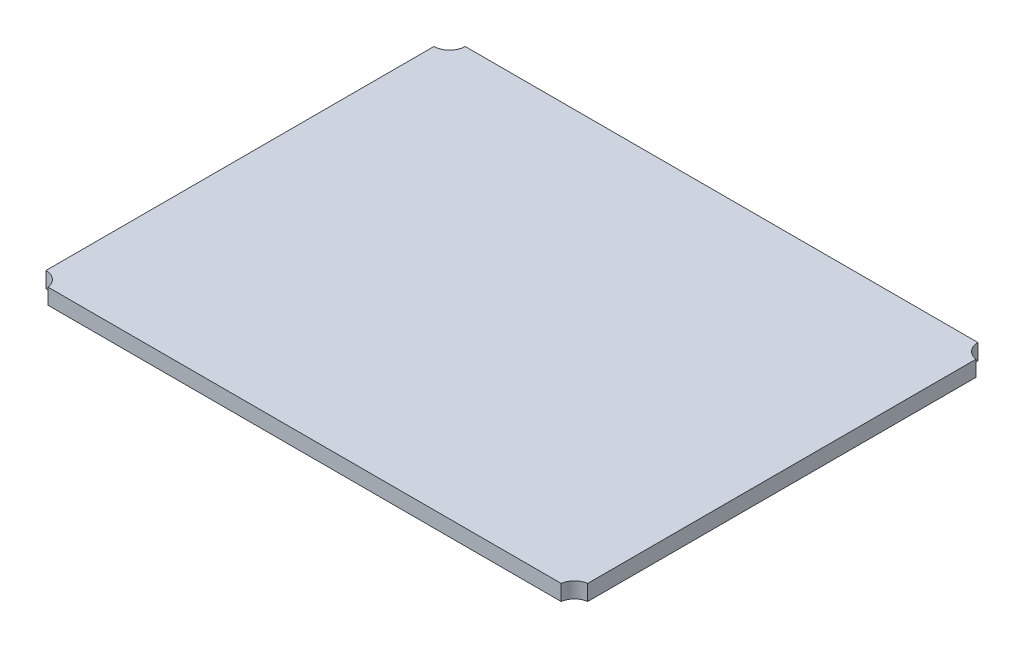
ISO-10303-21;
HEADER;
FILE_DESCRIPTION(('STEP AP214'),'2;1');
FILE_NAME('part.step','',(''),(''),'','','');
FILE_SCHEMA(('AUTOMOTIVE_DESIGN { 1 0 10303 214 1 1 1 1 }'));
ENDSEC;
DATA;
#1=APPLICATION_CONTEXT('core data for automotive mechanical design processes');
#2=APPLICATION_PROTOCOL_DEFINITION('international standard','automotive_design',2000,#1);
#3=PRODUCT_CONTEXT('',#1,'mechanical');
#4=PRODUCT('Part','Part','',(#3));
#5=PRODUCT_RELATED_PRODUCT_CATEGORY('part','',(#4));
#6=PRODUCT_DEFINITION_FORMATION('','',#4);
#7=PRODUCT_DEFINITION_CONTEXT('part definition',#1,'design');
#8=PRODUCT_DEFINITION('design','',#6,#7);
#9=PRODUCT_DEFINITION_SHAPE('','',#8);
#10=(LENGTH_UNIT() NAMED_UNIT(*) SI_UNIT(.MILLI.,.METRE.));
#11=(NAMED_UNIT(*) PLANE_ANGLE_UNIT() SI_UNIT($,.RADIAN.));
#12=(NAMED_UNIT(*) SI_UNIT($,.STERADIAN.) SOLID_ANGLE_UNIT());
#13=UNCERTAINTY_MEASURE_WITH_UNIT(LENGTH_MEASURE(1.E-05),#10,'distance_accuracy_value','');
#14=(GEOMETRIC_REPRESENTATION_CONTEXT(3) GLOBAL_UNCERTAINTY_ASSIGNED_CONTEXT((#13)) GLOBAL_UNIT_ASSIGNED_CONTEXT((#10,
#11,#12)) REPRESENTATION_CONTEXT('',''));
#15=CARTESIAN_POINT('',(0.,0.,0.));
#16=DIRECTION('',(0.,0.,1.));
#17=DIRECTION('',(1.,0.,0.));
#18=AXIS2_PLACEMENT_3D('',#15,#16,#17);
#19=CARTESIAN_POINT('',(0.,0.,0.));
#20=DIRECTION('',(0.,-1.,0.));
#21=DIRECTION('',(0.,0.,-1.));
#22=AXIS2_PLACEMENT_3D('',#19,#20,#21);
#23=PLANE('',#22);
#24=CARTESIAN_POINT('',(27.780996,0.,-21.209));
#25=DIRECTION('',(0.,1.,0.));
#26=DIRECTION('',(0.,0.,1.));
#27=AXIS2_PLACEMENT_3D('',#24,#25,#26);
#28=CIRCLE('',#27,1.5875);
#29=CARTESIAN_POINT('',(26.193496,0.,-21.209));
#30=VERTEX_POINT('',#29);
#31=CARTESIAN_POINT('',(27.559,0.,-19.6370985953362));
#32=VERTEX_POINT('',#31);
#33=EDGE_CURVE('E120',#30,#32,#28,.T.);
#34=ORIENTED_EDGE('',*,*,#33,.T.);
#35=DIRECTION('',(0.,0.,1.));
#36=VECTOR('',#35,1.);
#37=CARTESIAN_POINT('',(27.559,0.,21.209));
#38=LINE('',#37,#36);
#39=CARTESIAN_POINT('',(27.559,0.,19.8590945953362));
#40=VERTEX_POINT('',#39);
#41=EDGE_CURVE('E98',#32,#40,#38,.T.);
#42=ORIENTED_EDGE('',*,*,#41,.T.);
#43=CARTESIAN_POINT('',(27.780996,0.,21.430996));
#44=DIRECTION('',(0.,1.,0.));
#45=DIRECTION('',(0.,0.,1.));
#46=AXIS2_PLACEMENT_3D('',#43,#44,#45);
#47=CIRCLE('',#46,1.5875);
#48=CARTESIAN_POINT('',(26.2090945953362,0.,21.209));
#49=VERTEX_POINT('',#48);
#50=EDGE_CURVE('E87',#40,#49,#47,.T.);
#51=ORIENTED_EDGE('',*,*,#50,.T.);
#52=DIRECTION('',(-1.,0.,0.));
#53=VECTOR('',#52,1.);
#54=CARTESIAN_POINT('',(-27.559,0.,21.209));
#55=LINE('',#54,#53);
#56=CARTESIAN_POINT('',(-25.9870985953362,0.,21.209));
#57=VERTEX_POINT('',#56);
#58=EDGE_CURVE('E86',#49,#57,#55,.T.);
#59=ORIENTED_EDGE('',*,*,#58,.T.);
#60=CARTESIAN_POINT('',(-27.559,0.,21.430996));
#61=DIRECTION('',(0.,1.,0.));
#62=DIRECTION('',(0.,0.,1.));
#63=AXIS2_PLACEMENT_3D('',#60,#61,#62);
#64=CIRCLE('',#63,1.5875);
#65=CARTESIAN_POINT('',(-27.559,0.,19.843496));
#66=VERTEX_POINT('',#65);
#67=EDGE_CURVE('E17',#57,#66,#64,.T.);
#68=ORIENTED_EDGE('',*,*,#67,.T.);
#69=DIRECTION('',(0.,0.,-1.));
#70=VECTOR('',#69,1.);
#71=CARTESIAN_POINT('',(-27.559,0.,21.209));
#72=LINE('',#71,#70);
#73=CARTESIAN_POINT('',(-27.559,0.,-19.6215));
#74=VERTEX_POINT('',#73);
#75=EDGE_CURVE('E106',#66,#74,#72,.T.);
#76=ORIENTED_EDGE('',*,*,#75,.T.);
#77=CARTESIAN_POINT('',(-27.559,0.,-21.209));
#78=DIRECTION('',(0.,1.,0.));
#79=DIRECTION('',(0.,0.,1.));
#80=AXIS2_PLACEMENT_3D('',#77,#78,#79);
#81=CIRCLE('',#80,1.5875);
#82=CARTESIAN_POINT('',(-25.9715,0.,-21.209));
#83=VERTEX_POINT('',#82);
#84=EDGE_CURVE('E121',#74,#83,#81,.T.);
#85=ORIENTED_EDGE('',*,*,#84,.T.);
#86=DIRECTION('',(1.,0.,0.));
#87=VECTOR('',#86,1.);
#88=CARTESIAN_POINT('',(-27.559,0.,-21.209));
#89=LINE('',#88,#87);
#90=EDGE_CURVE('E102',#83,#30,#89,.T.);
#91=ORIENTED_EDGE('',*,*,#90,.T.);
#92=EDGE_LOOP('',(#34,#42,#51,#59,#68,#76,#85,#91));
#93=FACE_BOUND('',#92,.T.);
#94=ADVANCED_FACE('F14',(#93),#23,.T.);
#95=CARTESIAN_POINT('',(-27.559,0.,21.430996));
#96=DIRECTION('',(0.,1.,0.));
#97=DIRECTION('',(0.,0.,1.));
#98=AXIS2_PLACEMENT_3D('',#95,#96,#97);
#99=CYLINDRICAL_SURFACE('',#98,1.5875);
#100=DIRECTION('',(0.,1.,0.));
#101=VECTOR('',#100,1.);
#102=CARTESIAN_POINT('',(-25.9870985953362,1.6,21.209));
#103=LINE('',#102,#101);
#104=CARTESIAN_POINT('',(-25.9870985953362,1.6,21.209));
#105=VERTEX_POINT('',#104);
#106=EDGE_CURVE('E80',#57,#105,#103,.T.);
#107=ORIENTED_EDGE('',*,*,#106,.T.);
#108=CARTESIAN_POINT('',(-27.559,1.6,21.430996));
#109=DIRECTION('',(0.,1.,0.));
#110=DIRECTION('',(0.,0.,1.));
#111=AXIS2_PLACEMENT_3D('',#108,#109,#110);
#112=CIRCLE('',#111,1.5875);
#113=CARTESIAN_POINT('',(-27.559,1.6,19.843496));
#114=VERTEX_POINT('',#113);
#115=EDGE_CURVE('E90',#105,#114,#112,.T.);
#116=ORIENTED_EDGE('',*,*,#115,.T.);
#117=DIRECTION('',(0.,1.,0.));
#118=VECTOR('',#117,1.);
#119=CARTESIAN_POINT('',(-27.559,1.6,19.843496));
#120=LINE('',#119,#118);
#121=EDGE_CURVE('E81',#114,#66,#120,.F.);
#122=ORIENTED_EDGE('',*,*,#121,.T.);
#123=ORIENTED_EDGE('',*,*,#67,.F.);
#124=EDGE_LOOP('',(#107,#116,#122,#123));
#125=FACE_BOUND('',#124,.T.);
#126=ADVANCED_FACE('F78',(#125),#99,.F.);
#127=CARTESIAN_POINT('',(-27.559,1.6,21.209));
#128=DIRECTION('',(1.,0.,0.));
#129=DIRECTION('',(0.,0.,-1.));
#130=AXIS2_PLACEMENT_3D('',#127,#128,#129);
#131=PLANE('',#130);
#132=ORIENTED_EDGE('',*,*,#121,.F.);
#133=DIRECTION('',(0.,0.,-1.));
#134=VECTOR('',#133,1.);
#135=CARTESIAN_POINT('',(-27.559,1.6,0.));
#136=LINE('',#135,#134);
#137=CARTESIAN_POINT('',(-27.559,1.6,-19.6215));
#138=VERTEX_POINT('',#137);
#139=EDGE_CURVE('E92',#114,#138,#136,.T.);
#140=ORIENTED_EDGE('',*,*,#139,.T.);
#141=DIRECTION('',(0.,1.,0.));
#142=VECTOR('',#141,1.);
#143=CARTESIAN_POINT('',(-27.559,0.,-19.6215));
#144=LINE('',#143,#142);
#145=EDGE_CURVE('E108',#138,#74,#144,.F.);
#146=ORIENTED_EDGE('',*,*,#145,.T.);
#147=ORIENTED_EDGE('',*,*,#75,.F.);
#148=EDGE_LOOP('',(#132,#140,#146,#147));
#149=FACE_BOUND('',#148,.T.);
#150=ADVANCED_FACE('F159',(#149),#131,.F.);
#151=CARTESIAN_POINT('',(-27.559,0.,-21.209));
#152=DIRECTION('',(0.,1.,0.));
#153=DIRECTION('',(0.,0.,1.));
#154=AXIS2_PLACEMENT_3D('',#151,#152,#153);
#155=CYLINDRICAL_SURFACE('',#154,1.5875);
#156=ORIENTED_EDGE('',*,*,#145,.F.);
#157=CARTESIAN_POINT('',(-27.559,1.6,-21.209));
#158=DIRECTION('',(0.,1.,0.));
#159=DIRECTION('',(0.,0.,1.));
#160=AXIS2_PLACEMENT_3D('',#157,#158,#159);
#161=CIRCLE('',#160,1.5875);
#162=CARTESIAN_POINT('',(-25.9715,1.6,-21.209));
#163=VERTEX_POINT('',#162);
#164=EDGE_CURVE('E116',#138,#163,#161,.T.);
#165=ORIENTED_EDGE('',*,*,#164,.T.);
#166=DIRECTION('',(0.,1.,0.));
#167=VECTOR('',#166,1.);
#168=CARTESIAN_POINT('',(-25.9715,1.6,-21.209));
#169=LINE('',#168,#167);
#170=EDGE_CURVE('E105',#163,#83,#169,.F.);
#171=ORIENTED_EDGE('',*,*,#170,.T.);
#172=ORIENTED_EDGE('',*,*,#84,.F.);
#173=EDGE_LOOP('',(#156,#165,#171,#172));
#174=FACE_BOUND('',#173,.T.);
#175=ADVANCED_FACE('F157',(#174),#155,.F.);
#176=CARTESIAN_POINT('',(-27.559,1.6,-21.209));
#177=DIRECTION('',(0.,0.,1.));
#178=DIRECTION('',(1.,0.,0.));
#179=AXIS2_PLACEMENT_3D('',#176,#177,#178);
#180=PLANE('',#179);
#181=DIRECTION('',(0.,1.,0.));
#182=VECTOR('',#181,1.);
#183=CARTESIAN_POINT('',(26.193496,0.,-21.209));
#184=LINE('',#183,#182);
#185=CARTESIAN_POINT('',(26.193496,1.6,-21.209));
#186=VERTEX_POINT('',#185);
#187=EDGE_CURVE('E104',#186,#30,#184,.F.);
#188=ORIENTED_EDGE('',*,*,#187,.T.);
#189=ORIENTED_EDGE('',*,*,#90,.F.);
#190=ORIENTED_EDGE('',*,*,#170,.F.);
#191=DIRECTION('',(1.,0.,0.));
#192=VECTOR('',#191,1.);
#193=CARTESIAN_POINT('',(0.,1.6,-21.209));
#194=LINE('',#193,#192);
#195=EDGE_CURVE('E115',#163,#186,#194,.T.);
#196=ORIENTED_EDGE('',*,*,#195,.T.);
#197=EDGE_LOOP('',(#188,#189,#190,#196));
#198=FACE_BOUND('',#197,.T.);
#199=ADVANCED_FACE('F153',(#198),#180,.F.);
#200=CARTESIAN_POINT('',(27.780996,0.,-21.209));
#201=DIRECTION('',(0.,1.,0.));
#202=DIRECTION('',(0.,0.,1.));
#203=AXIS2_PLACEMENT_3D('',#200,#201,#202);
#204=CYLINDRICAL_SURFACE('',#203,1.5875);
#205=ORIENTED_EDGE('',*,*,#187,.F.);
#206=CARTESIAN_POINT('',(27.780996,1.6,-21.209));
#207=DIRECTION('',(0.,1.,0.));
#208=DIRECTION('',(0.,0.,1.));
#209=AXIS2_PLACEMENT_3D('',#206,#207,#208);
#210=CIRCLE('',#209,1.5875);
#211=CARTESIAN_POINT('',(27.559,1.6,-19.6370985953362));
#212=VERTEX_POINT('',#211);
#213=EDGE_CURVE('E112',#186,#212,#210,.T.);
#214=ORIENTED_EDGE('',*,*,#213,.T.);
#215=DIRECTION('',(0.,1.,0.));
#216=VECTOR('',#215,1.);
#217=CARTESIAN_POINT('',(27.559,1.6,-19.6370985953362));
#218=LINE('',#217,#216);
#219=EDGE_CURVE('E101',#212,#32,#218,.F.);
#220=ORIENTED_EDGE('',*,*,#219,.T.);
#221=ORIENTED_EDGE('',*,*,#33,.F.);
#222=EDGE_LOOP('',(#205,#214,#220,#221));
#223=FACE_BOUND('',#222,.T.);
#224=ADVANCED_FACE('F150',(#223),#204,.F.);
#225=CARTESIAN_POINT('',(27.559,1.6,21.209));
#226=DIRECTION('',(-1.,0.,0.));
#227=DIRECTION('',(0.,0.,1.));
#228=AXIS2_PLACEMENT_3D('',#225,#226,#227);
#229=PLANE('',#228);
#230=DIRECTION('',(0.,1.,0.));
#231=VECTOR('',#230,1.);
#232=CARTESIAN_POINT('',(27.559,0.,19.8590945953362));
#233=LINE('',#232,#231);
#234=CARTESIAN_POINT('',(27.559,1.6,19.8590945953362));
#235=VERTEX_POINT('',#234);
#236=EDGE_CURVE('E100',#235,#40,#233,.F.);
#237=ORIENTED_EDGE('',*,*,#236,.T.);
#238=ORIENTED_EDGE('',*,*,#41,.F.);
#239=ORIENTED_EDGE('',*,*,#219,.F.);
#240=DIRECTION('',(0.,0.,-1.));
#241=VECTOR('',#240,1.);
#242=CARTESIAN_POINT('',(27.559,1.6,0.));
#243=LINE('',#242,#241);
#244=EDGE_CURVE('E111',#212,#235,#243,.F.);
#245=ORIENTED_EDGE('',*,*,#244,.T.);
#246=EDGE_LOOP('',(#237,#238,#239,#245));
#247=FACE_BOUND('',#246,.T.);
#248=ADVANCED_FACE('F142',(#247),#229,.F.);
#249=CARTESIAN_POINT('',(27.780996,0.,21.430996));
#250=DIRECTION('',(0.,1.,0.));
#251=DIRECTION('',(0.,0.,1.));
#252=AXIS2_PLACEMENT_3D('',#249,#250,#251);
#253=CYLINDRICAL_SURFACE('',#252,1.5875);
#254=DIRECTION('',(0.,1.,0.));
#255=VECTOR('',#254,1.);
#256=CARTESIAN_POINT('',(26.2090945953362,1.6,21.209));
#257=LINE('',#256,#255);
#258=CARTESIAN_POINT('',(26.2090945953362,1.6,21.209));
#259=VERTEX_POINT('',#258);
#260=EDGE_CURVE('E31',#259,#49,#257,.F.);
#261=ORIENTED_EDGE('',*,*,#260,.T.);
#262=ORIENTED_EDGE('',*,*,#50,.F.);
#263=ORIENTED_EDGE('',*,*,#236,.F.);
#264=CARTESIAN_POINT('',(27.780996,1.6,21.430996));
#265=DIRECTION('',(0.,1.,0.));
#266=DIRECTION('',(0.,0.,1.));
#267=AXIS2_PLACEMENT_3D('',#264,#265,#266);
#268=CIRCLE('',#267,1.5875);
#269=EDGE_CURVE('E23',#235,#259,#268,.T.);
#270=ORIENTED_EDGE('',*,*,#269,.T.);
#271=EDGE_LOOP('',(#261,#262,#263,#270));
#272=FACE_BOUND('',#271,.T.);
#273=ADVANCED_FACE('F173',(#272),#253,.F.);
#274=CARTESIAN_POINT('',(-27.559,1.6,21.209));
#275=DIRECTION('',(0.,0.,-1.));
#276=DIRECTION('',(-1.,0.,0.));
#277=AXIS2_PLACEMENT_3D('',#274,#275,#276);
#278=PLANE('',#277);
#279=ORIENTED_EDGE('',*,*,#260,.F.);
#280=DIRECTION('',(1.,0.,0.));
#281=VECTOR('',#280,1.);
#282=CARTESIAN_POINT('',(0.,1.6,21.209));
#283=LINE('',#282,#281);
#284=EDGE_CURVE('E9',#259,#105,#283,.F.);
#285=ORIENTED_EDGE('',*,*,#284,.T.);
#286=ORIENTED_EDGE('',*,*,#106,.F.);
#287=ORIENTED_EDGE('',*,*,#58,.F.);
#288=EDGE_LOOP('',(#279,#285,#286,#287));
#289=FACE_BOUND('',#288,.T.);
#290=ADVANCED_FACE('F85',(#289),#278,.F.);
#291=CARTESIAN_POINT('',(0.,1.6,0.));
#292=DIRECTION('',(0.,-1.,0.));
#293=DIRECTION('',(0.,0.,-1.));
#294=AXIS2_PLACEMENT_3D('',#291,#292,#293);
#295=PLANE('',#294);
#296=ORIENTED_EDGE('',*,*,#269,.F.);
#297=ORIENTED_EDGE('',*,*,#244,.F.);
#298=ORIENTED_EDGE('',*,*,#213,.F.);
#299=ORIENTED_EDGE('',*,*,#195,.F.);
#300=ORIENTED_EDGE('',*,*,#164,.F.);
#301=ORIENTED_EDGE('',*,*,#139,.F.);
#302=ORIENTED_EDGE('',*,*,#115,.F.);
#303=ORIENTED_EDGE('',*,*,#284,.F.);
#304=EDGE_LOOP('',(#296,#297,#298,#299,#300,#301,#302,#303));
#305=FACE_BOUND('',#304,.T.);
#306=ADVANCED_FACE('F147',(#305),#295,.F.);
#307=CLOSED_SHELL('',(#94,#126,#150,#175,#199,#224,#248,#273,#290,#306));
#308=MANIFOLD_SOLID_BREP('B1',#307);
#309=ADVANCED_BREP_SHAPE_REPRESENTATION('',(#18,#308),#14);
#310=SHAPE_DEFINITION_REPRESENTATION(#9,#309);
ENDSEC;
END-ISO-10303-21;
